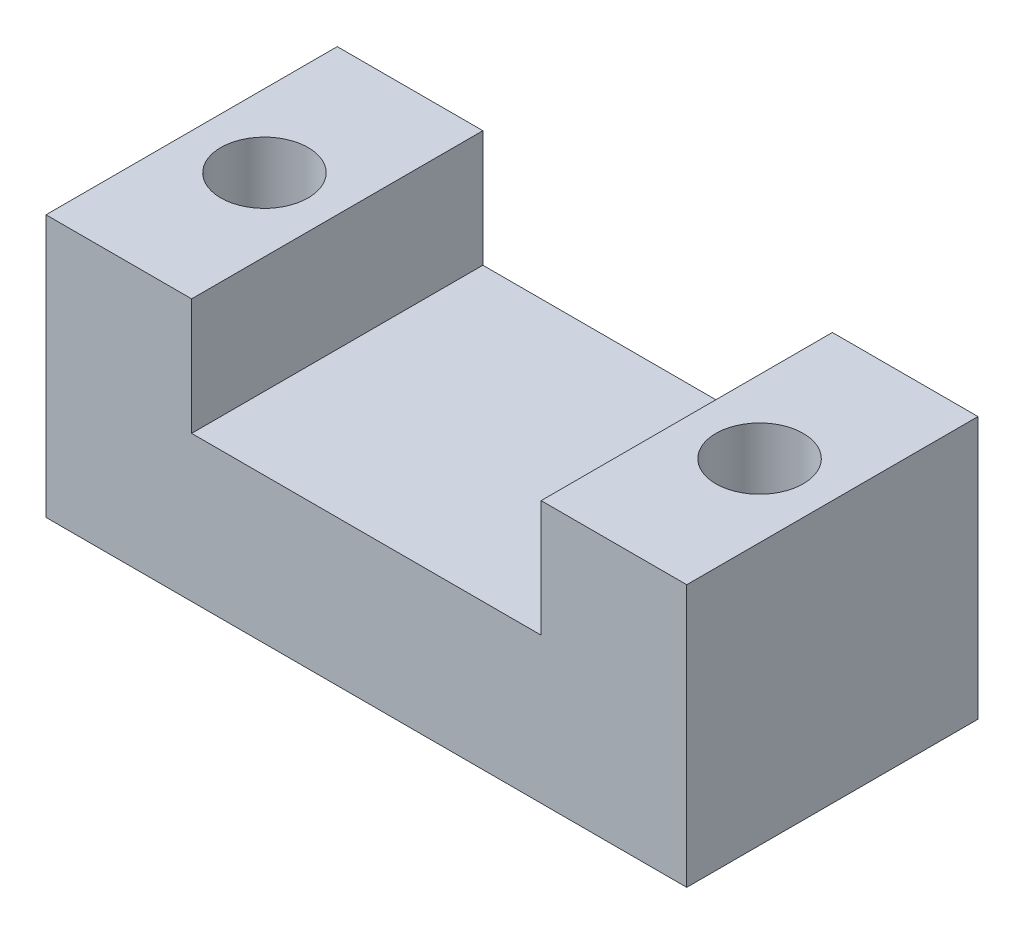
ISO-10303-21;
HEADER;
FILE_DESCRIPTION(('STEP AP214'),'2;1');
FILE_NAME('part.step','',(''),(''),'','','');
FILE_SCHEMA(('AUTOMOTIVE_DESIGN { 1 0 10303 214 1 1 1 1 }'));
ENDSEC;
DATA;
#1=APPLICATION_CONTEXT('core data for automotive mechanical design processes');
#2=APPLICATION_PROTOCOL_DEFINITION('international standard','automotive_design',2000,#1);
#3=PRODUCT_CONTEXT('',#1,'mechanical');
#4=PRODUCT('Part','Part','',(#3));
#5=PRODUCT_RELATED_PRODUCT_CATEGORY('part','',(#4));
#6=PRODUCT_DEFINITION_FORMATION('','',#4);
#7=PRODUCT_DEFINITION_CONTEXT('part definition',#1,'design');
#8=PRODUCT_DEFINITION('design','',#6,#7);
#9=PRODUCT_DEFINITION_SHAPE('','',#8);
#10=(LENGTH_UNIT() NAMED_UNIT(*) SI_UNIT(.MILLI.,.METRE.));
#11=(NAMED_UNIT(*) PLANE_ANGLE_UNIT() SI_UNIT($,.RADIAN.));
#12=(NAMED_UNIT(*) SI_UNIT($,.STERADIAN.) SOLID_ANGLE_UNIT());
#13=UNCERTAINTY_MEASURE_WITH_UNIT(LENGTH_MEASURE(1.E-05),#10,'distance_accuracy_value','');
#14=(GEOMETRIC_REPRESENTATION_CONTEXT(3) GLOBAL_UNCERTAINTY_ASSIGNED_CONTEXT((#13)) GLOBAL_UNIT_ASSIGNED_CONTEXT((#10,
#11,#12)) REPRESENTATION_CONTEXT('',''));
#15=CARTESIAN_POINT('',(0.,0.,0.));
#16=DIRECTION('',(0.,0.,1.));
#17=DIRECTION('',(1.,0.,0.));
#18=AXIS2_PLACEMENT_3D('',#15,#16,#17);
#19=CARTESIAN_POINT('',(0.,5.,0.));
#20=DIRECTION('',(0.,-1.,0.));
#21=DIRECTION('',(0.,0.,-1.));
#22=AXIS2_PLACEMENT_3D('',#19,#20,#21);
#23=PLANE('',#22);
#24=DIRECTION('',(0.,0.,1.));
#25=VECTOR('',#24,1.);
#26=CARTESIAN_POINT('',(6.,5.,-5.));
#27=LINE('',#26,#25);
#28=CARTESIAN_POINT('',(6.,5.,-5.));
#29=VERTEX_POINT('',#28);
#30=CARTESIAN_POINT('',(6.,5.,5.));
#31=VERTEX_POINT('',#30);
#32=EDGE_CURVE('E48',#29,#31,#27,.T.);
#33=ORIENTED_EDGE('',*,*,#32,.F.);
#34=DIRECTION('',(-1.,0.,0.));
#35=VECTOR('',#34,1.);
#36=CARTESIAN_POINT('',(-11.,5.,-5.));
#37=LINE('',#36,#35);
#38=CARTESIAN_POINT('',(-6.,5.,-5.));
#39=VERTEX_POINT('',#38);
#40=EDGE_CURVE('E156',#29,#39,#37,.T.);
#41=ORIENTED_EDGE('',*,*,#40,.T.);
#42=DIRECTION('',(0.,0.,-1.));
#43=VECTOR('',#42,1.);
#44=CARTESIAN_POINT('',(-6.,5.,-5.));
#45=LINE('',#44,#43);
#46=CARTESIAN_POINT('',(-6.,5.,5.));
#47=VERTEX_POINT('',#46);
#48=EDGE_CURVE('E131',#47,#39,#45,.T.);
#49=ORIENTED_EDGE('',*,*,#48,.F.);
#50=DIRECTION('',(1.,0.,0.));
#51=VECTOR('',#50,1.);
#52=CARTESIAN_POINT('',(-11.,5.,5.));
#53=LINE('',#52,#51);
#54=EDGE_CURVE('E53',#47,#31,#53,.T.);
#55=ORIENTED_EDGE('',*,*,#54,.T.);
#56=EDGE_LOOP('',(#33,#41,#49,#55));
#57=FACE_BOUND('',#56,.T.);
#58=ADVANCED_FACE('F33',(#57),#23,.F.);
#59=CARTESIAN_POINT('',(0.,0.,0.));
#60=DIRECTION('',(0.,-1.,0.));
#61=DIRECTION('',(0.,0.,-1.));
#62=AXIS2_PLACEMENT_3D('',#59,#60,#61);
#63=PLANE('',#62);
#64=CARTESIAN_POINT('',(-8.5,0.,0.));
#65=DIRECTION('',(0.,1.,0.));
#66=DIRECTION('',(0.,0.,1.));
#67=AXIS2_PLACEMENT_3D('',#64,#65,#66);
#68=CIRCLE('',#67,1.5);
#69=CARTESIAN_POINT('',(-8.5,0.,1.5));
#70=VERTEX_POINT('',#69);
#71=EDGE_CURVE('E153',#70,#70,#68,.T.);
#72=ORIENTED_EDGE('',*,*,#71,.T.);
#73=EDGE_LOOP('',(#72));
#74=FACE_BOUND('',#73,.T.);
#75=DIRECTION('',(0.,0.,-1.));
#76=VECTOR('',#75,1.);
#77=CARTESIAN_POINT('',(11.,0.,5.));
#78=LINE('',#77,#76);
#79=CARTESIAN_POINT('',(11.,0.,5.));
#80=VERTEX_POINT('',#79);
#81=CARTESIAN_POINT('',(11.,0.,-5.));
#82=VERTEX_POINT('',#81);
#83=EDGE_CURVE('E101',#80,#82,#78,.T.);
#84=ORIENTED_EDGE('',*,*,#83,.F.);
#85=DIRECTION('',(1.,0.,0.));
#86=VECTOR('',#85,1.);
#87=CARTESIAN_POINT('',(-11.,0.,5.));
#88=LINE('',#87,#86);
#89=CARTESIAN_POINT('',(-11.,0.,5.));
#90=VERTEX_POINT('',#89);
#91=EDGE_CURVE('E158',#90,#80,#88,.T.);
#92=ORIENTED_EDGE('',*,*,#91,.F.);
#93=DIRECTION('',(0.,0.,1.));
#94=VECTOR('',#93,1.);
#95=CARTESIAN_POINT('',(-11.,0.,5.));
#96=LINE('',#95,#94);
#97=CARTESIAN_POINT('',(-11.,0.,-5.));
#98=VERTEX_POINT('',#97);
#99=EDGE_CURVE('E164',#98,#90,#96,.T.);
#100=ORIENTED_EDGE('',*,*,#99,.F.);
#101=DIRECTION('',(-1.,0.,0.));
#102=VECTOR('',#101,1.);
#103=CARTESIAN_POINT('',(-11.,0.,-5.));
#104=LINE('',#103,#102);
#105=EDGE_CURVE('E162',#82,#98,#104,.T.);
#106=ORIENTED_EDGE('',*,*,#105,.F.);
#107=EDGE_LOOP('',(#84,#92,#100,#106));
#108=FACE_BOUND('',#107,.T.);
#109=CARTESIAN_POINT('',(8.5,0.,0.));
#110=DIRECTION('',(0.,1.,0.));
#111=DIRECTION('',(0.,0.,1.));
#112=AXIS2_PLACEMENT_3D('',#109,#110,#111);
#113=CIRCLE('',#112,1.5);
#114=CARTESIAN_POINT('',(8.5,0.,1.5));
#115=VERTEX_POINT('',#114);
#116=EDGE_CURVE('E150',#115,#115,#113,.T.);
#117=ORIENTED_EDGE('',*,*,#116,.T.);
#118=EDGE_LOOP('',(#117));
#119=FACE_BOUND('',#118,.T.);
#120=ADVANCED_FACE('F178',(#74,#108,#119),#63,.T.);
#121=CARTESIAN_POINT('',(11.,5.,5.));
#122=DIRECTION('',(-1.,0.,0.));
#123=DIRECTION('',(0.,0.,1.));
#124=AXIS2_PLACEMENT_3D('',#121,#122,#123);
#125=PLANE('',#124);
#126=ORIENTED_EDGE('',*,*,#83,.T.);
#127=DIRECTION('',(0.,-1.,0.));
#128=VECTOR('',#127,1.);
#129=CARTESIAN_POINT('',(11.,5.,-5.));
#130=LINE('',#129,#128);
#131=CARTESIAN_POINT('',(11.,9.,-5.));
#132=VERTEX_POINT('',#131);
#133=EDGE_CURVE('E11',#132,#82,#130,.T.);
#134=ORIENTED_EDGE('',*,*,#133,.F.);
#135=DIRECTION('',(0.,0.,-1.));
#136=VECTOR('',#135,1.);
#137=CARTESIAN_POINT('',(11.,9.,-5.));
#138=LINE('',#137,#136);
#139=CARTESIAN_POINT('',(11.,9.,5.));
#140=VERTEX_POINT('',#139);
#141=EDGE_CURVE('E99',#140,#132,#138,.T.);
#142=ORIENTED_EDGE('',*,*,#141,.F.);
#143=DIRECTION('',(0.,-1.,0.));
#144=VECTOR('',#143,1.);
#145=CARTESIAN_POINT('',(11.,5.,5.));
#146=LINE('',#145,#144);
#147=EDGE_CURVE('E160',#140,#80,#146,.T.);
#148=ORIENTED_EDGE('',*,*,#147,.T.);
#149=EDGE_LOOP('',(#126,#134,#142,#148));
#150=FACE_BOUND('',#149,.T.);
#151=ADVANCED_FACE('F35',(#150),#125,.F.);
#152=CARTESIAN_POINT('',(-11.,5.,-5.));
#153=DIRECTION('',(0.,0.,1.));
#154=DIRECTION('',(1.,0.,0.));
#155=AXIS2_PLACEMENT_3D('',#152,#153,#154);
#156=PLANE('',#155);
#157=ORIENTED_EDGE('',*,*,#105,.T.);
#158=DIRECTION('',(0.,-1.,0.));
#159=VECTOR('',#158,1.);
#160=CARTESIAN_POINT('',(-11.,5.,-5.));
#161=LINE('',#160,#159);
#162=CARTESIAN_POINT('',(-11.,9.,-5.));
#163=VERTEX_POINT('',#162);
#164=EDGE_CURVE('E41',#163,#98,#161,.T.);
#165=ORIENTED_EDGE('',*,*,#164,.F.);
#166=DIRECTION('',(-1.,0.,0.));
#167=VECTOR('',#166,1.);
#168=CARTESIAN_POINT('',(-11.,9.,-5.));
#169=LINE('',#168,#167);
#170=CARTESIAN_POINT('',(-6.,9.,-5.));
#171=VERTEX_POINT('',#170);
#172=EDGE_CURVE('E139',#171,#163,#169,.T.);
#173=ORIENTED_EDGE('',*,*,#172,.F.);
#174=DIRECTION('',(0.,-1.,0.));
#175=VECTOR('',#174,1.);
#176=CARTESIAN_POINT('',(-6.,9.,-5.));
#177=LINE('',#176,#175);
#178=EDGE_CURVE('E142',#171,#39,#177,.T.);
#179=ORIENTED_EDGE('',*,*,#178,.T.);
#180=ORIENTED_EDGE('',*,*,#40,.F.);
#181=DIRECTION('',(0.,-1.,0.));
#182=VECTOR('',#181,1.);
#183=CARTESIAN_POINT('',(6.,9.,-5.));
#184=LINE('',#183,#182);
#185=CARTESIAN_POINT('',(6.,9.,-5.));
#186=VERTEX_POINT('',#185);
#187=EDGE_CURVE('E107',#186,#29,#184,.T.);
#188=ORIENTED_EDGE('',*,*,#187,.F.);
#189=DIRECTION('',(-1.,0.,0.));
#190=VECTOR('',#189,1.);
#191=CARTESIAN_POINT('',(11.,9.,-5.));
#192=LINE('',#191,#190);
#193=EDGE_CURVE('E104',#132,#186,#192,.T.);
#194=ORIENTED_EDGE('',*,*,#193,.F.);
#195=ORIENTED_EDGE('',*,*,#133,.T.);
#196=EDGE_LOOP('',(#157,#165,#173,#179,#180,#188,#194,#195));
#197=FACE_BOUND('',#196,.T.);
#198=ADVANCED_FACE('F105',(#197),#156,.F.);
#199=CARTESIAN_POINT('',(-11.,5.,5.));
#200=DIRECTION('',(1.,0.,0.));
#201=DIRECTION('',(0.,0.,-1.));
#202=AXIS2_PLACEMENT_3D('',#199,#200,#201);
#203=PLANE('',#202);
#204=ORIENTED_EDGE('',*,*,#99,.T.);
#205=DIRECTION('',(0.,-1.,0.));
#206=VECTOR('',#205,1.);
#207=CARTESIAN_POINT('',(-11.,5.,5.));
#208=LINE('',#207,#206);
#209=CARTESIAN_POINT('',(-11.,9.,5.));
#210=VERTEX_POINT('',#209);
#211=EDGE_CURVE('E168',#210,#90,#208,.T.);
#212=ORIENTED_EDGE('',*,*,#211,.F.);
#213=DIRECTION('',(0.,0.,1.));
#214=VECTOR('',#213,1.);
#215=CARTESIAN_POINT('',(-11.,9.,-5.));
#216=LINE('',#215,#214);
#217=EDGE_CURVE('E132',#163,#210,#216,.T.);
#218=ORIENTED_EDGE('',*,*,#217,.F.);
#219=ORIENTED_EDGE('',*,*,#164,.T.);
#220=EDGE_LOOP('',(#204,#212,#218,#219));
#221=FACE_BOUND('',#220,.T.);
#222=ADVANCED_FACE('F174',(#221),#203,.F.);
#223=CARTESIAN_POINT('',(-11.,5.,5.));
#224=DIRECTION('',(0.,0.,-1.));
#225=DIRECTION('',(-1.,0.,0.));
#226=AXIS2_PLACEMENT_3D('',#223,#224,#225);
#227=PLANE('',#226);
#228=ORIENTED_EDGE('',*,*,#91,.T.);
#229=ORIENTED_EDGE('',*,*,#147,.F.);
#230=DIRECTION('',(1.,0.,0.));
#231=VECTOR('',#230,1.);
#232=CARTESIAN_POINT('',(11.,9.,5.));
#233=LINE('',#232,#231);
#234=CARTESIAN_POINT('',(6.,9.,5.));
#235=VERTEX_POINT('',#234);
#236=EDGE_CURVE('E116',#235,#140,#233,.T.);
#237=ORIENTED_EDGE('',*,*,#236,.F.);
#238=DIRECTION('',(0.,-1.,0.));
#239=VECTOR('',#238,1.);
#240=CARTESIAN_POINT('',(6.,9.,5.));
#241=LINE('',#240,#239);
#242=EDGE_CURVE('E123',#235,#31,#241,.T.);
#243=ORIENTED_EDGE('',*,*,#242,.T.);
#244=ORIENTED_EDGE('',*,*,#54,.F.);
#245=DIRECTION('',(0.,-1.,0.));
#246=VECTOR('',#245,1.);
#247=CARTESIAN_POINT('',(-6.,9.,5.));
#248=LINE('',#247,#246);
#249=CARTESIAN_POINT('',(-6.,9.,5.));
#250=VERTEX_POINT('',#249);
#251=EDGE_CURVE('E147',#250,#47,#248,.T.);
#252=ORIENTED_EDGE('',*,*,#251,.F.);
#253=DIRECTION('',(1.,0.,0.));
#254=VECTOR('',#253,1.);
#255=CARTESIAN_POINT('',(-11.,9.,5.));
#256=LINE('',#255,#254);
#257=EDGE_CURVE('E135',#210,#250,#256,.T.);
#258=ORIENTED_EDGE('',*,*,#257,.F.);
#259=ORIENTED_EDGE('',*,*,#211,.T.);
#260=EDGE_LOOP('',(#228,#229,#237,#243,#244,#252,#258,#259));
#261=FACE_BOUND('',#260,.T.);
#262=ADVANCED_FACE('F181',(#261),#227,.F.);
#263=CARTESIAN_POINT('',(-8.5,5.,0.));
#264=DIRECTION('',(0.,-1.,0.));
#265=DIRECTION('',(0.,0.,-1.));
#266=AXIS2_PLACEMENT_3D('',#263,#264,#265);
#267=CYLINDRICAL_SURFACE('',#266,1.5);
#268=ORIENTED_EDGE('',*,*,#71,.F.);
#269=EDGE_LOOP('',(#268));
#270=FACE_BOUND('',#269,.T.);
#271=CARTESIAN_POINT('',(-8.5,9.,0.));
#272=DIRECTION('',(0.,1.,0.));
#273=DIRECTION('',(0.,0.,1.));
#274=AXIS2_PLACEMENT_3D('',#271,#272,#273);
#275=CIRCLE('',#274,1.5);
#276=CARTESIAN_POINT('',(-8.5,9.,1.5));
#277=VERTEX_POINT('',#276);
#278=EDGE_CURVE('E128',#277,#277,#275,.T.);
#279=ORIENTED_EDGE('',*,*,#278,.T.);
#280=EDGE_LOOP('',(#279));
#281=FACE_BOUND('',#280,.T.);
#282=ADVANCED_FACE('F211',(#270,#281),#267,.F.);
#283=CARTESIAN_POINT('',(8.5,5.,0.));
#284=DIRECTION('',(0.,-1.,0.));
#285=DIRECTION('',(0.,0.,-1.));
#286=AXIS2_PLACEMENT_3D('',#283,#284,#285);
#287=CYLINDRICAL_SURFACE('',#286,1.5);
#288=ORIENTED_EDGE('',*,*,#116,.F.);
#289=EDGE_LOOP('',(#288));
#290=FACE_BOUND('',#289,.T.);
#291=CARTESIAN_POINT('',(8.5,9.,0.));
#292=DIRECTION('',(0.,1.,0.));
#293=DIRECTION('',(0.,0.,1.));
#294=AXIS2_PLACEMENT_3D('',#291,#292,#293);
#295=CIRCLE('',#294,1.5);
#296=CARTESIAN_POINT('',(8.5,9.,1.5));
#297=VERTEX_POINT('',#296);
#298=EDGE_CURVE('E118',#297,#297,#295,.T.);
#299=ORIENTED_EDGE('',*,*,#298,.T.);
#300=EDGE_LOOP('',(#299));
#301=FACE_BOUND('',#300,.T.);
#302=ADVANCED_FACE('F265',(#290,#301),#287,.F.);
#303=CARTESIAN_POINT('',(0.,9.,0.));
#304=DIRECTION('',(0.,1.,0.));
#305=DIRECTION('',(0.,0.,1.));
#306=AXIS2_PLACEMENT_3D('',#303,#304,#305);
#307=PLANE('',#306);
#308=ORIENTED_EDGE('',*,*,#217,.T.);
#309=ORIENTED_EDGE('',*,*,#257,.T.);
#310=DIRECTION('',(0.,0.,-1.));
#311=VECTOR('',#310,1.);
#312=CARTESIAN_POINT('',(-6.,9.,-5.));
#313=LINE('',#312,#311);
#314=EDGE_CURVE('E137',#250,#171,#313,.T.);
#315=ORIENTED_EDGE('',*,*,#314,.T.);
#316=ORIENTED_EDGE('',*,*,#172,.T.);
#317=EDGE_LOOP('',(#308,#309,#315,#316));
#318=FACE_BOUND('',#317,.T.);
#319=ORIENTED_EDGE('',*,*,#278,.F.);
#320=EDGE_LOOP('',(#319));
#321=FACE_BOUND('',#320,.T.);
#322=ADVANCED_FACE('F186',(#318,#321),#307,.T.);
#323=CARTESIAN_POINT('',(-6.,9.,-5.));
#324=DIRECTION('',(-1.,0.,0.));
#325=DIRECTION('',(0.,0.,1.));
#326=AXIS2_PLACEMENT_3D('',#323,#324,#325);
#327=PLANE('',#326);
#328=ORIENTED_EDGE('',*,*,#48,.T.);
#329=ORIENTED_EDGE('',*,*,#178,.F.);
#330=ORIENTED_EDGE('',*,*,#314,.F.);
#331=ORIENTED_EDGE('',*,*,#251,.T.);
#332=EDGE_LOOP('',(#328,#329,#330,#331));
#333=FACE_BOUND('',#332,.T.);
#334=ADVANCED_FACE('F190',(#333),#327,.F.);
#335=CARTESIAN_POINT('',(0.,9.,0.));
#336=DIRECTION('',(0.,-1.,0.));
#337=DIRECTION('',(0.,0.,-1.));
#338=AXIS2_PLACEMENT_3D('',#335,#336,#337);
#339=PLANE('',#338);
#340=ORIENTED_EDGE('',*,*,#141,.T.);
#341=ORIENTED_EDGE('',*,*,#193,.T.);
#342=DIRECTION('',(0.,0.,1.));
#343=VECTOR('',#342,1.);
#344=CARTESIAN_POINT('',(6.,9.,-5.));
#345=LINE('',#344,#343);
#346=EDGE_CURVE('E110',#186,#235,#345,.T.);
#347=ORIENTED_EDGE('',*,*,#346,.T.);
#348=ORIENTED_EDGE('',*,*,#236,.T.);
#349=EDGE_LOOP('',(#340,#341,#347,#348));
#350=FACE_BOUND('',#349,.T.);
#351=ORIENTED_EDGE('',*,*,#298,.F.);
#352=EDGE_LOOP('',(#351));
#353=FACE_BOUND('',#352,.T.);
#354=ADVANCED_FACE('F113',(#350,#353),#339,.F.);
#355=CARTESIAN_POINT('',(6.,9.,-5.));
#356=DIRECTION('',(1.,0.,0.));
#357=DIRECTION('',(0.,0.,-1.));
#358=AXIS2_PLACEMENT_3D('',#355,#356,#357);
#359=PLANE('',#358);
#360=ORIENTED_EDGE('',*,*,#32,.T.);
#361=ORIENTED_EDGE('',*,*,#242,.F.);
#362=ORIENTED_EDGE('',*,*,#346,.F.);
#363=ORIENTED_EDGE('',*,*,#187,.T.);
#364=EDGE_LOOP('',(#360,#361,#362,#363));
#365=FACE_BOUND('',#364,.T.);
#366=ADVANCED_FACE('F193',(#365),#359,.F.);
#367=CLOSED_SHELL('',(#58,#120,#151,#198,#222,#262,#282,#302,#322,#334,#354,#366));
#368=MANIFOLD_SOLID_BREP('B2',#367);
#369=ADVANCED_BREP_SHAPE_REPRESENTATION('',(#18,#368),#14);
#370=SHAPE_DEFINITION_REPRESENTATION(#9,#369);
ENDSEC;
END-ISO-10303-21;
